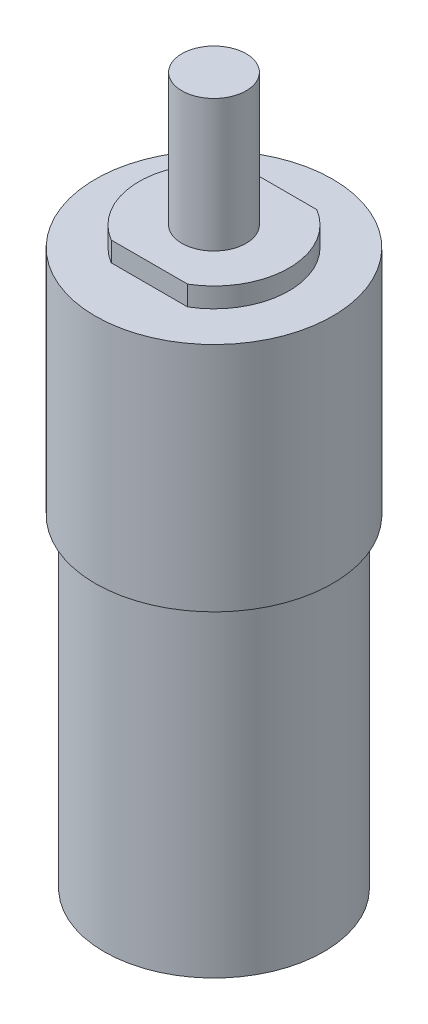
ISO-10303-21;
HEADER;
FILE_DESCRIPTION(('STEP AP214'),'2;1');
FILE_NAME('part.step','',(''),(''),'','','');
FILE_SCHEMA(('AUTOMOTIVE_DESIGN { 1 0 10303 214 1 1 1 1 }'));
ENDSEC;
DATA;
#1=APPLICATION_CONTEXT('core data for automotive mechanical design processes');
#2=APPLICATION_PROTOCOL_DEFINITION('international standard','automotive_design',2000,#1);
#3=PRODUCT_CONTEXT('',#1,'mechanical');
#4=PRODUCT('Part','Part','',(#3));
#5=PRODUCT_RELATED_PRODUCT_CATEGORY('part','',(#4));
#6=PRODUCT_DEFINITION_FORMATION('','',#4);
#7=PRODUCT_DEFINITION_CONTEXT('part definition',#1,'design');
#8=PRODUCT_DEFINITION('design','',#6,#7);
#9=PRODUCT_DEFINITION_SHAPE('','',#8);
#10=(LENGTH_UNIT() NAMED_UNIT(*) SI_UNIT(.MILLI.,.METRE.));
#11=(NAMED_UNIT(*) PLANE_ANGLE_UNIT() SI_UNIT($,.RADIAN.));
#12=(NAMED_UNIT(*) SI_UNIT($,.STERADIAN.) SOLID_ANGLE_UNIT());
#13=UNCERTAINTY_MEASURE_WITH_UNIT(LENGTH_MEASURE(1.E-05),#10,'distance_accuracy_value','');
#14=(GEOMETRIC_REPRESENTATION_CONTEXT(3) GLOBAL_UNCERTAINTY_ASSIGNED_CONTEXT((#13)) GLOBAL_UNIT_ASSIGNED_CONTEXT((#10,
#11,#12)) REPRESENTATION_CONTEXT('',''));
#15=CARTESIAN_POINT('',(0.,0.,0.));
#16=DIRECTION('',(0.,0.,1.));
#17=DIRECTION('',(1.,0.,0.));
#18=AXIS2_PLACEMENT_3D('',#15,#16,#17);
#19=CARTESIAN_POINT('',(0.,53.1368,0.));
#20=DIRECTION('',(0.,-1.,0.));
#21=DIRECTION('',(0.,0.,-1.));
#22=AXIS2_PLACEMENT_3D('',#19,#20,#21);
#23=CYLINDRICAL_SURFACE('',#22,6.9342);
#24=CARTESIAN_POINT('',(0.,53.1368,0.));
#25=DIRECTION('',(0.,1.,0.));
#26=DIRECTION('',(0.,0.,1.));
#27=AXIS2_PLACEMENT_3D('',#24,#25,#26);
#28=CIRCLE('',#27,6.9342);
#29=CARTESIAN_POINT('',(-3.52904642077715,53.1368,-5.969));
#30=VERTEX_POINT('',#29);
#31=CARTESIAN_POINT('',(-3.5290464207772,53.1368,5.969));
#32=VERTEX_POINT('',#31);
#33=EDGE_CURVE('E105',#30,#32,#28,.T.);
#34=ORIENTED_EDGE('',*,*,#33,.F.);
#35=DIRECTION('',(0.,1.,0.));
#36=VECTOR('',#35,1.);
#37=CARTESIAN_POINT('',(-3.5290464207772,44.1842169039195,-5.969));
#38=LINE('',#37,#36);
#39=CARTESIAN_POINT('',(-3.5290464207772,51.308,-5.969));
#40=VERTEX_POINT('',#39);
#41=EDGE_CURVE('E57',#40,#30,#38,.T.);
#42=ORIENTED_EDGE('',*,*,#41,.F.);
#43=CARTESIAN_POINT('',(0.,51.308,0.));
#44=DIRECTION('',(0.,1.,0.));
#45=DIRECTION('',(0.,0.,1.));
#46=AXIS2_PLACEMENT_3D('',#43,#44,#45);
#47=CIRCLE('',#46,6.9342);
#48=CARTESIAN_POINT('',(-3.5290464207772,51.308,5.969));
#49=VERTEX_POINT('',#48);
#50=EDGE_CURVE('E49',#40,#49,#47,.T.);
#51=ORIENTED_EDGE('',*,*,#50,.T.);
#52=DIRECTION('',(0.,1.,0.));
#53=VECTOR('',#52,1.);
#54=CARTESIAN_POINT('',(-3.5290464207772,44.1842169039195,5.969));
#55=LINE('',#54,#53);
#56=EDGE_CURVE('E178',#49,#32,#55,.T.);
#57=ORIENTED_EDGE('',*,*,#56,.T.);
#58=EDGE_LOOP('',(#34,#42,#51,#57));
#59=FACE_BOUND('',#58,.T.);
#60=ADVANCED_FACE('F39',(#59),#23,.T.);
#61=CARTESIAN_POINT('',(0.,29.8958,0.));
#62=DIRECTION('',(0.,-1.,0.));
#63=DIRECTION('',(0.,0.,-1.));
#64=AXIS2_PLACEMENT_3D('',#61,#62,#63);
#65=CYLINDRICAL_SURFACE('',#64,10.16);
#66=CARTESIAN_POINT('',(0.,29.8958,0.));
#67=DIRECTION('',(0.,1.,0.));
#68=DIRECTION('',(0.,0.,1.));
#69=AXIS2_PLACEMENT_3D('',#66,#67,#68);
#70=CIRCLE('',#69,10.16);
#71=CARTESIAN_POINT('',(0.,29.8958,10.16));
#72=VERTEX_POINT('',#71);
#73=EDGE_CURVE('E120',#72,#72,#70,.T.);
#74=ORIENTED_EDGE('',*,*,#73,.F.);
#75=EDGE_LOOP('',(#74));
#76=FACE_BOUND('',#75,.T.);
#77=CARTESIAN_POINT('',(0.,0.,0.));
#78=DIRECTION('',(0.,1.,0.));
#79=DIRECTION('',(0.,0.,1.));
#80=AXIS2_PLACEMENT_3D('',#77,#78,#79);
#81=CIRCLE('',#80,10.16);
#82=CARTESIAN_POINT('',(0.,0.,10.16));
#83=VERTEX_POINT('',#82);
#84=EDGE_CURVE('E118',#83,#83,#81,.T.);
#85=ORIENTED_EDGE('',*,*,#84,.T.);
#86=EDGE_LOOP('',(#85));
#87=FACE_BOUND('',#86,.T.);
#88=ADVANCED_FACE('F41',(#76,#87),#65,.T.);
#89=CARTESIAN_POINT('',(0.,0.,0.));
#90=DIRECTION('',(0.,1.,0.));
#91=DIRECTION('',(0.,0.,1.));
#92=AXIS2_PLACEMENT_3D('',#89,#90,#91);
#93=PLANE('',#92);
#94=ORIENTED_EDGE('',*,*,#84,.F.);
#95=EDGE_LOOP('',(#94));
#96=FACE_BOUND('',#95,.T.);
#97=ADVANCED_FACE('F128',(#96),#93,.F.);
#98=CARTESIAN_POINT('',(0.,51.308,0.));
#99=DIRECTION('',(0.,-1.,0.));
#100=DIRECTION('',(0.,0.,-1.));
#101=AXIS2_PLACEMENT_3D('',#98,#99,#100);
#102=CYLINDRICAL_SURFACE('',#101,10.9728);
#103=CARTESIAN_POINT('',(0.,51.308,0.));
#104=DIRECTION('',(0.,1.,0.));
#105=DIRECTION('',(0.,0.,1.));
#106=AXIS2_PLACEMENT_3D('',#103,#104,#105);
#107=CIRCLE('',#106,10.9728);
#108=CARTESIAN_POINT('',(0.,51.308,10.9728));
#109=VERTEX_POINT('',#108);
#110=EDGE_CURVE('E110',#109,#109,#107,.T.);
#111=ORIENTED_EDGE('',*,*,#110,.F.);
#112=EDGE_LOOP('',(#111));
#113=FACE_BOUND('',#112,.T.);
#114=CARTESIAN_POINT('',(0.,29.8958,0.));
#115=DIRECTION('',(0.,1.,0.));
#116=DIRECTION('',(0.,0.,1.));
#117=AXIS2_PLACEMENT_3D('',#114,#115,#116);
#118=CIRCLE('',#117,10.9728);
#119=CARTESIAN_POINT('',(0.,29.8958,10.9728));
#120=VERTEX_POINT('',#119);
#121=EDGE_CURVE('E104',#120,#120,#118,.T.);
#122=ORIENTED_EDGE('',*,*,#121,.T.);
#123=EDGE_LOOP('',(#122));
#124=FACE_BOUND('',#123,.T.);
#125=ADVANCED_FACE('F130',(#113,#124),#102,.T.);
#126=CARTESIAN_POINT('',(0.,51.308,0.));
#127=DIRECTION('',(0.,1.,0.));
#128=DIRECTION('',(0.,0.,1.));
#129=AXIS2_PLACEMENT_3D('',#126,#127,#128);
#130=PLANE('',#129);
#131=CARTESIAN_POINT('',(3.5290464207772,51.308,5.969));
#132=VERTEX_POINT('',#131);
#133=CARTESIAN_POINT('',(3.5290464207772,51.308,-5.969));
#134=VERTEX_POINT('',#133);
#135=EDGE_CURVE('E11',#132,#134,#47,.T.);
#136=ORIENTED_EDGE('',*,*,#135,.F.);
#137=DIRECTION('',(1.,0.,0.));
#138=VECTOR('',#137,1.);
#139=CARTESIAN_POINT('',(3.5290464207772,51.308,5.969));
#140=LINE('',#139,#138);
#141=EDGE_CURVE('E90',#49,#132,#140,.T.);
#142=ORIENTED_EDGE('',*,*,#141,.F.);
#143=ORIENTED_EDGE('',*,*,#50,.F.);
#144=DIRECTION('',(-1.,0.,0.));
#145=VECTOR('',#144,1.);
#146=CARTESIAN_POINT('',(-3.5290464207772,51.308,-5.969));
#147=LINE('',#146,#145);
#148=EDGE_CURVE('E98',#134,#40,#147,.T.);
#149=ORIENTED_EDGE('',*,*,#148,.F.);
#150=EDGE_LOOP('',(#136,#142,#143,#149));
#151=FACE_BOUND('',#150,.T.);
#152=ORIENTED_EDGE('',*,*,#110,.T.);
#153=EDGE_LOOP('',(#152));
#154=FACE_BOUND('',#153,.T.);
#155=ADVANCED_FACE('F135',(#151,#154),#130,.T.);
#156=CARTESIAN_POINT('',(0.,29.8958,0.));
#157=DIRECTION('',(0.,1.,0.));
#158=DIRECTION('',(0.,0.,1.));
#159=AXIS2_PLACEMENT_3D('',#156,#157,#158);
#160=PLANE('',#159);
#161=ORIENTED_EDGE('',*,*,#73,.T.);
#162=EDGE_LOOP('',(#161));
#163=FACE_BOUND('',#162,.T.);
#164=ORIENTED_EDGE('',*,*,#121,.F.);
#165=EDGE_LOOP('',(#164));
#166=FACE_BOUND('',#165,.T.);
#167=ADVANCED_FACE('F147',(#163,#166),#160,.F.);
#168=ORIENTED_EDGE('',*,*,#135,.T.);
#169=DIRECTION('',(0.,1.,0.));
#170=VECTOR('',#169,1.);
#171=CARTESIAN_POINT('',(3.5290464207772,44.1842169039195,-5.969));
#172=LINE('',#171,#170);
#173=CARTESIAN_POINT('',(3.5290464207772,53.1368,-5.969));
#174=VERTEX_POINT('',#173);
#175=EDGE_CURVE('E83',#134,#174,#172,.T.);
#176=ORIENTED_EDGE('',*,*,#175,.T.);
#177=CARTESIAN_POINT('',(3.52904642077715,53.1368,5.969));
#178=VERTEX_POINT('',#177);
#179=EDGE_CURVE('E95',#178,#174,#28,.T.);
#180=ORIENTED_EDGE('',*,*,#179,.F.);
#181=DIRECTION('',(0.,1.,0.));
#182=VECTOR('',#181,1.);
#183=CARTESIAN_POINT('',(3.5290464207772,44.1842169039195,5.969));
#184=LINE('',#183,#182);
#185=EDGE_CURVE('E65',#132,#178,#184,.T.);
#186=ORIENTED_EDGE('',*,*,#185,.F.);
#187=EDGE_LOOP('',(#168,#176,#180,#186));
#188=FACE_BOUND('',#187,.T.);
#189=ADVANCED_FACE('F94',(#188),#23,.T.);
#190=CARTESIAN_POINT('',(0.,53.1368,0.));
#191=DIRECTION('',(0.,1.,0.));
#192=DIRECTION('',(0.,0.,1.));
#193=AXIS2_PLACEMENT_3D('',#190,#191,#192);
#194=PLANE('',#193);
#195=DIRECTION('',(1.,0.,0.));
#196=VECTOR('',#195,1.);
#197=CARTESIAN_POINT('',(-3.5290464207772,53.1368,-5.969));
#198=LINE('',#197,#196);
#199=EDGE_CURVE('E80',#30,#174,#198,.T.);
#200=ORIENTED_EDGE('',*,*,#199,.F.);
#201=ORIENTED_EDGE('',*,*,#33,.T.);
#202=DIRECTION('',(-1.,0.,0.));
#203=VECTOR('',#202,1.);
#204=CARTESIAN_POINT('',(3.5290464207772,53.1368,5.969));
#205=LINE('',#204,#203);
#206=EDGE_CURVE('E102',#178,#32,#205,.T.);
#207=ORIENTED_EDGE('',*,*,#206,.F.);
#208=ORIENTED_EDGE('',*,*,#179,.T.);
#209=EDGE_LOOP('',(#200,#201,#207,#208));
#210=FACE_BOUND('',#209,.T.);
#211=CARTESIAN_POINT('',(0.,53.1368,0.));
#212=DIRECTION('',(0.,1.,0.));
#213=DIRECTION('',(0.,0.,1.));
#214=AXIS2_PLACEMENT_3D('',#211,#212,#213);
#215=CIRCLE('',#214,2.9718);
#216=CARTESIAN_POINT('',(0.,53.1368,2.9718));
#217=VERTEX_POINT('',#216);
#218=EDGE_CURVE('E43',#217,#217,#215,.F.);
#219=ORIENTED_EDGE('',*,*,#218,.T.);
#220=EDGE_LOOP('',(#219));
#221=FACE_BOUND('',#220,.T.);
#222=ADVANCED_FACE('F100',(#210,#221),#194,.T.);
#223=CARTESIAN_POINT('',(0.,65.3542,0.));
#224=DIRECTION('',(0.,-1.,0.));
#225=DIRECTION('',(0.,0.,-1.));
#226=AXIS2_PLACEMENT_3D('',#223,#224,#225);
#227=CYLINDRICAL_SURFACE('',#226,2.9718);
#228=ORIENTED_EDGE('',*,*,#218,.F.);
#229=EDGE_LOOP('',(#228));
#230=FACE_BOUND('',#229,.T.);
#231=CARTESIAN_POINT('',(0.,65.3542,0.));
#232=DIRECTION('',(0.,1.,0.));
#233=DIRECTION('',(0.,0.,1.));
#234=AXIS2_PLACEMENT_3D('',#231,#232,#233);
#235=CIRCLE('',#234,2.9718);
#236=CARTESIAN_POINT('',(0.,65.3542,2.9718));
#237=VERTEX_POINT('',#236);
#238=EDGE_CURVE('E113',#237,#237,#235,.T.);
#239=ORIENTED_EDGE('',*,*,#238,.F.);
#240=EDGE_LOOP('',(#239));
#241=FACE_BOUND('',#240,.T.);
#242=ADVANCED_FACE('F152',(#230,#241),#227,.T.);
#243=CARTESIAN_POINT('',(0.,65.3542,0.));
#244=DIRECTION('',(0.,1.,0.));
#245=DIRECTION('',(0.,0.,1.));
#246=AXIS2_PLACEMENT_3D('',#243,#244,#245);
#247=PLANE('',#246);
#248=ORIENTED_EDGE('',*,*,#238,.T.);
#249=EDGE_LOOP('',(#248));
#250=FACE_BOUND('',#249,.T.);
#251=ADVANCED_FACE('F188',(#250),#247,.T.);
#252=CARTESIAN_POINT('',(3.5290464207772,44.1842169039195,5.969));
#253=DIRECTION('',(0.,0.,-1.));
#254=DIRECTION('',(-1.,0.,0.));
#255=AXIS2_PLACEMENT_3D('',#252,#253,#254);
#256=PLANE('',#255);
#257=ORIENTED_EDGE('',*,*,#141,.T.);
#258=ORIENTED_EDGE('',*,*,#185,.T.);
#259=ORIENTED_EDGE('',*,*,#206,.T.);
#260=ORIENTED_EDGE('',*,*,#56,.F.);
#261=EDGE_LOOP('',(#257,#258,#259,#260));
#262=FACE_BOUND('',#261,.T.);
#263=ADVANCED_FACE('F184',(#262),#256,.F.);
#264=CARTESIAN_POINT('',(-3.5290464207772,44.1842169039195,-5.969));
#265=DIRECTION('',(0.,0.,1.));
#266=DIRECTION('',(1.,0.,0.));
#267=AXIS2_PLACEMENT_3D('',#264,#265,#266);
#268=PLANE('',#267);
#269=ORIENTED_EDGE('',*,*,#148,.T.);
#270=ORIENTED_EDGE('',*,*,#41,.T.);
#271=ORIENTED_EDGE('',*,*,#199,.T.);
#272=ORIENTED_EDGE('',*,*,#175,.F.);
#273=EDGE_LOOP('',(#269,#270,#271,#272));
#274=FACE_BOUND('',#273,.T.);
#275=ADVANCED_FACE('F82',(#274),#268,.F.);
#276=CLOSED_SHELL('',(#60,#88,#97,#125,#155,#167,#189,#222,#242,#251,#263,#275));
#277=MANIFOLD_SOLID_BREP('B2',#276);
#278=ADVANCED_BREP_SHAPE_REPRESENTATION('',(#18,#277),#14);
#279=SHAPE_DEFINITION_REPRESENTATION(#9,#278);
ENDSEC;
END-ISO-10303-21;
